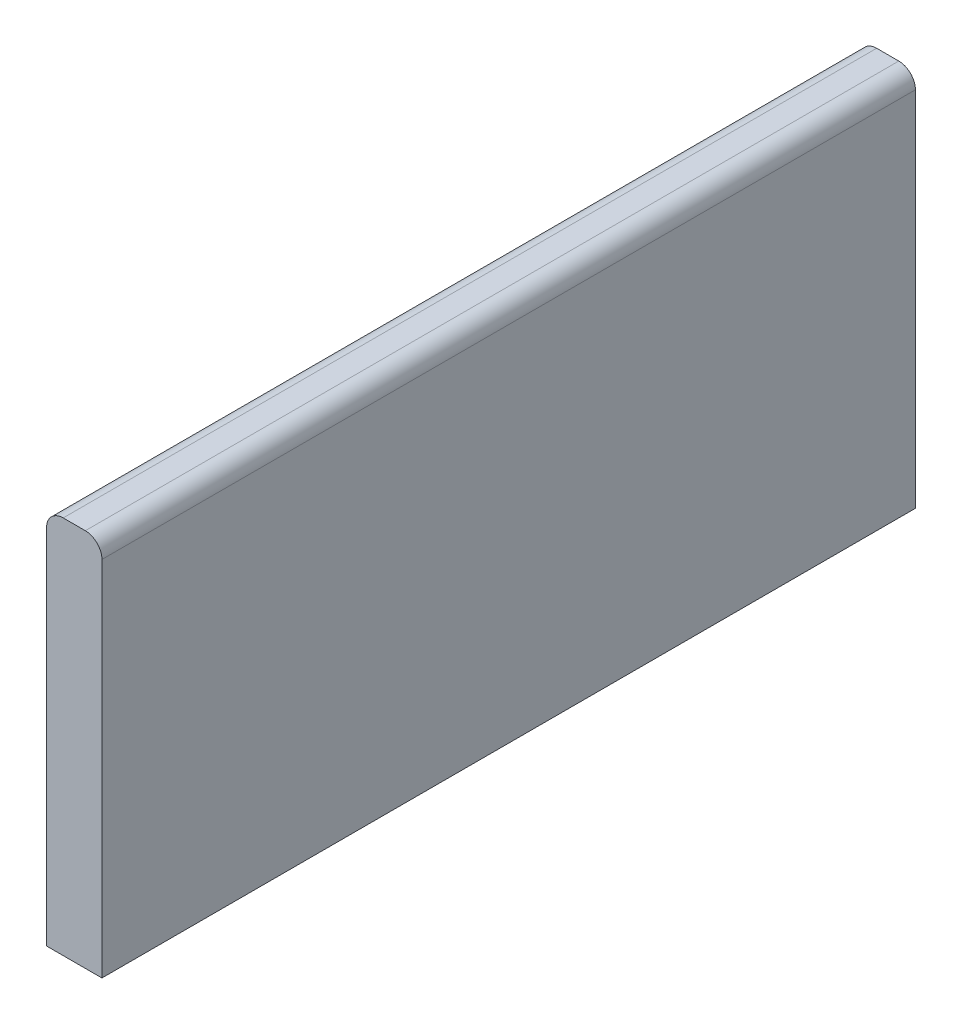
ISO-10303-21;
HEADER;
FILE_DESCRIPTION(('STEP AP214'),'2;1');
FILE_NAME('part.step','',(''),(''),'','','');
FILE_SCHEMA(('AUTOMOTIVE_DESIGN { 1 0 10303 214 1 1 1 1 }'));
ENDSEC;
DATA;
#1=APPLICATION_CONTEXT('core data for automotive mechanical design processes');
#2=APPLICATION_PROTOCOL_DEFINITION('international standard','automotive_design',2000,#1);
#3=PRODUCT_CONTEXT('',#1,'mechanical');
#4=PRODUCT('Part','Part','',(#3));
#5=PRODUCT_RELATED_PRODUCT_CATEGORY('part','',(#4));
#6=PRODUCT_DEFINITION_FORMATION('','',#4);
#7=PRODUCT_DEFINITION_CONTEXT('part definition',#1,'design');
#8=PRODUCT_DEFINITION('design','',#6,#7);
#9=PRODUCT_DEFINITION_SHAPE('','',#8);
#10=(LENGTH_UNIT() NAMED_UNIT(*) SI_UNIT(.MILLI.,.METRE.));
#11=(NAMED_UNIT(*) PLANE_ANGLE_UNIT() SI_UNIT($,.RADIAN.));
#12=(NAMED_UNIT(*) SI_UNIT($,.STERADIAN.) SOLID_ANGLE_UNIT());
#13=UNCERTAINTY_MEASURE_WITH_UNIT(LENGTH_MEASURE(1.E-05),#10,'distance_accuracy_value','');
#14=(GEOMETRIC_REPRESENTATION_CONTEXT(3) GLOBAL_UNCERTAINTY_ASSIGNED_CONTEXT((#13)) GLOBAL_UNIT_ASSIGNED_CONTEXT((#10,
#11,#12)) REPRESENTATION_CONTEXT('',''));
#15=CARTESIAN_POINT('',(0.,0.,0.));
#16=DIRECTION('',(0.,0.,1.));
#17=DIRECTION('',(1.,0.,0.));
#18=AXIS2_PLACEMENT_3D('',#15,#16,#17);
#19=CARTESIAN_POINT('',(-95.,-4.99999999999998,216.226078900946));
#20=DIRECTION('',(-1.,0.,0.));
#21=DIRECTION('',(0.,-1.,0.));
#22=AXIS2_PLACEMENT_3D('',#19,#20,#21);
#23=PLANE('',#22);
#24=DIRECTION('',(0.,1.,0.));
#25=VECTOR('',#24,1.);
#26=CARTESIAN_POINT('',(-95.,-4.99999999999998,0.));
#27=LINE('',#26,#25);
#28=CARTESIAN_POINT('',(-95.,-73.5000000000002,0.));
#29=VERTEX_POINT('',#28);
#30=CARTESIAN_POINT('',(-95.,-7.99999999999998,0.));
#31=VERTEX_POINT('',#30);
#32=EDGE_CURVE('E132',#29,#31,#27,.T.);
#33=ORIENTED_EDGE('',*,*,#32,.T.);
#34=DIRECTION('',(0.,0.,-1.));
#35=VECTOR('',#34,1.);
#36=CARTESIAN_POINT('',(-95.,-7.99999999999998,216.226078900946));
#37=LINE('',#36,#35);
#38=CARTESIAN_POINT('',(-95.,-7.99999999999998,147.));
#39=VERTEX_POINT('',#38);
#40=EDGE_CURVE('E11',#31,#39,#37,.F.);
#41=ORIENTED_EDGE('',*,*,#40,.T.);
#42=DIRECTION('',(0.,1.,0.));
#43=VECTOR('',#42,1.);
#44=CARTESIAN_POINT('',(-95.,-4.99999999999998,147.));
#45=LINE('',#44,#43);
#46=CARTESIAN_POINT('',(-95.,-73.5000000000002,147.));
#47=VERTEX_POINT('',#46);
#48=EDGE_CURVE('E122',#47,#39,#45,.T.);
#49=ORIENTED_EDGE('',*,*,#48,.F.);
#50=DIRECTION('',(0.,0.,-1.));
#51=VECTOR('',#50,1.);
#52=CARTESIAN_POINT('',(-95.,-73.5000000000002,216.226078900946));
#53=LINE('',#52,#51);
#54=EDGE_CURVE('E120',#47,#29,#53,.T.);
#55=ORIENTED_EDGE('',*,*,#54,.T.);
#56=EDGE_LOOP('',(#33,#41,#49,#55));
#57=FACE_BOUND('',#56,.T.);
#58=ADVANCED_FACE('F39',(#57),#23,.F.);
#59=CARTESIAN_POINT('',(-95.,-4.99999999999998,216.226078900946));
#60=DIRECTION('',(0.,-1.,0.));
#61=DIRECTION('',(0.,0.,-1.));
#62=AXIS2_PLACEMENT_3D('',#59,#60,#61);
#63=PLANE('',#62);
#64=DIRECTION('',(-1.,0.,0.));
#65=VECTOR('',#64,1.);
#66=CARTESIAN_POINT('',(-95.,-4.99999999999998,0.));
#67=LINE('',#66,#65);
#68=CARTESIAN_POINT('',(-98.,-4.99999999999998,0.));
#69=VERTEX_POINT('',#68);
#70=CARTESIAN_POINT('',(-102.,-4.99999999999998,0.));
#71=VERTEX_POINT('',#70);
#72=EDGE_CURVE('E154',#69,#71,#67,.T.);
#73=ORIENTED_EDGE('',*,*,#72,.T.);
#74=DIRECTION('',(0.,0.,-1.));
#75=VECTOR('',#74,1.);
#76=CARTESIAN_POINT('',(-102.,-4.99999999999998,216.226078900946));
#77=LINE('',#76,#75);
#78=CARTESIAN_POINT('',(-102.,-4.99999999999998,147.));
#79=VERTEX_POINT('',#78);
#80=EDGE_CURVE('E61',#71,#79,#77,.F.);
#81=ORIENTED_EDGE('',*,*,#80,.T.);
#82=DIRECTION('',(-1.,0.,0.));
#83=VECTOR('',#82,1.);
#84=CARTESIAN_POINT('',(-95.,-4.99999999999998,147.));
#85=LINE('',#84,#83);
#86=CARTESIAN_POINT('',(-98.,-4.99999999999998,147.));
#87=VERTEX_POINT('',#86);
#88=EDGE_CURVE('E106',#87,#79,#85,.T.);
#89=ORIENTED_EDGE('',*,*,#88,.F.);
#90=DIRECTION('',(0.,0.,-1.));
#91=VECTOR('',#90,1.);
#92=CARTESIAN_POINT('',(-98.,-4.99999999999998,216.226078900946));
#93=LINE('',#92,#91);
#94=EDGE_CURVE('E141',#87,#69,#93,.T.);
#95=ORIENTED_EDGE('',*,*,#94,.T.);
#96=EDGE_LOOP('',(#73,#81,#89,#95));
#97=FACE_BOUND('',#96,.T.);
#98=ADVANCED_FACE('F159',(#97),#63,.F.);
#99=CARTESIAN_POINT('',(-105.,-4.99999999999998,216.226078900946));
#100=DIRECTION('',(1.,0.,0.));
#101=DIRECTION('',(0.,1.,0.));
#102=AXIS2_PLACEMENT_3D('',#99,#100,#101);
#103=PLANE('',#102);
#104=DIRECTION('',(0.,-1.,0.));
#105=VECTOR('',#104,1.);
#106=CARTESIAN_POINT('',(-105.,-4.99999999999998,147.));
#107=LINE('',#106,#105);
#108=CARTESIAN_POINT('',(-105.,-7.99999999999998,147.));
#109=VERTEX_POINT('',#108);
#110=CARTESIAN_POINT('',(-105.,-73.5000000000002,147.));
#111=VERTEX_POINT('',#110);
#112=EDGE_CURVE('E95',#109,#111,#107,.T.);
#113=ORIENTED_EDGE('',*,*,#112,.F.);
#114=DIRECTION('',(0.,0.,-1.));
#115=VECTOR('',#114,1.);
#116=CARTESIAN_POINT('',(-105.,-7.99999999999998,216.226078900946));
#117=LINE('',#116,#115);
#118=CARTESIAN_POINT('',(-105.,-7.99999999999998,0.));
#119=VERTEX_POINT('',#118);
#120=EDGE_CURVE('E105',#109,#119,#117,.T.);
#121=ORIENTED_EDGE('',*,*,#120,.T.);
#122=DIRECTION('',(0.,-1.,0.));
#123=VECTOR('',#122,1.);
#124=CARTESIAN_POINT('',(-105.,-4.99999999999998,0.));
#125=LINE('',#124,#123);
#126=CARTESIAN_POINT('',(-105.,-73.5000000000002,0.));
#127=VERTEX_POINT('',#126);
#128=EDGE_CURVE('E112',#119,#127,#125,.T.);
#129=ORIENTED_EDGE('',*,*,#128,.T.);
#130=DIRECTION('',(0.,0.,-1.));
#131=VECTOR('',#130,1.);
#132=CARTESIAN_POINT('',(-105.,-73.5000000000002,216.226078900946));
#133=LINE('',#132,#131);
#134=EDGE_CURVE('E109',#111,#127,#133,.T.);
#135=ORIENTED_EDGE('',*,*,#134,.F.);
#136=EDGE_LOOP('',(#113,#121,#129,#135));
#137=FACE_BOUND('',#136,.T.);
#138=ADVANCED_FACE('F110',(#137),#103,.F.);
#139=CARTESIAN_POINT('',(-95.,-73.5000000000002,216.226078900946));
#140=DIRECTION('',(0.,1.,0.));
#141=DIRECTION('',(0.,0.,1.));
#142=AXIS2_PLACEMENT_3D('',#139,#140,#141);
#143=PLANE('',#142);
#144=DIRECTION('',(1.,0.,0.));
#145=VECTOR('',#144,1.);
#146=CARTESIAN_POINT('',(-95.,-73.5000000000002,147.));
#147=LINE('',#146,#145);
#148=EDGE_CURVE('E99',#111,#47,#147,.T.);
#149=ORIENTED_EDGE('',*,*,#148,.F.);
#150=ORIENTED_EDGE('',*,*,#134,.T.);
#151=DIRECTION('',(1.,0.,0.));
#152=VECTOR('',#151,1.);
#153=CARTESIAN_POINT('',(-95.,-73.5000000000002,0.));
#154=LINE('',#153,#152);
#155=EDGE_CURVE('E117',#127,#29,#154,.T.);
#156=ORIENTED_EDGE('',*,*,#155,.T.);
#157=ORIENTED_EDGE('',*,*,#54,.F.);
#158=EDGE_LOOP('',(#149,#150,#156,#157));
#159=FACE_BOUND('',#158,.T.);
#160=ADVANCED_FACE('F119',(#159),#143,.F.);
#161=CARTESIAN_POINT('',(0.,0.,0.));
#162=DIRECTION('',(0.,0.,-1.));
#163=DIRECTION('',(-1.,0.,0.));
#164=AXIS2_PLACEMENT_3D('',#161,#162,#163);
#165=PLANE('',#164);
#166=ORIENTED_EDGE('',*,*,#128,.F.);
#167=CARTESIAN_POINT('',(-102.,-7.99999999999998,0.));
#168=DIRECTION('',(0.,0.,-1.));
#169=DIRECTION('',(-1.,0.,0.));
#170=AXIS2_PLACEMENT_3D('',#167,#168,#169);
#171=CIRCLE('',#170,3.);
#172=EDGE_CURVE('E138',#119,#71,#171,.T.);
#173=ORIENTED_EDGE('',*,*,#172,.T.);
#174=ORIENTED_EDGE('',*,*,#72,.F.);
#175=CARTESIAN_POINT('',(-98.,-7.99999999999998,0.));
#176=DIRECTION('',(0.,0.,-1.));
#177=DIRECTION('',(-1.,0.,0.));
#178=AXIS2_PLACEMENT_3D('',#175,#176,#177);
#179=CIRCLE('',#178,3.);
#180=EDGE_CURVE('E135',#69,#31,#179,.T.);
#181=ORIENTED_EDGE('',*,*,#180,.T.);
#182=ORIENTED_EDGE('',*,*,#32,.F.);
#183=ORIENTED_EDGE('',*,*,#155,.F.);
#184=EDGE_LOOP('',(#166,#173,#174,#181,#182,#183));
#185=FACE_BOUND('',#184,.T.);
#186=ADVANCED_FACE('F164',(#185),#165,.T.);
#187=CARTESIAN_POINT('',(-1.31838984174237E-13,-536.02351291583,147.));
#188=DIRECTION('',(0.,0.,1.));
#189=DIRECTION('',(0.,1.,0.));
#190=AXIS2_PLACEMENT_3D('',#187,#188,#189);
#191=PLANE('',#190);
#192=ORIENTED_EDGE('',*,*,#88,.T.);
#193=CARTESIAN_POINT('',(-102.,-7.99999999999998,147.));
#194=DIRECTION('',(0.,0.,1.));
#195=DIRECTION('',(1.,0.,0.));
#196=AXIS2_PLACEMENT_3D('',#193,#194,#195);
#197=CIRCLE('',#196,3.);
#198=EDGE_CURVE('E48',#79,#109,#197,.T.);
#199=ORIENTED_EDGE('',*,*,#198,.T.);
#200=ORIENTED_EDGE('',*,*,#112,.T.);
#201=ORIENTED_EDGE('',*,*,#148,.T.);
#202=ORIENTED_EDGE('',*,*,#48,.T.);
#203=CARTESIAN_POINT('',(-98.,-7.99999999999998,147.));
#204=DIRECTION('',(0.,0.,1.));
#205=DIRECTION('',(1.,0.,0.));
#206=AXIS2_PLACEMENT_3D('',#203,#204,#205);
#207=CIRCLE('',#206,3.);
#208=EDGE_CURVE('E147',#39,#87,#207,.T.);
#209=ORIENTED_EDGE('',*,*,#208,.T.);
#210=EDGE_LOOP('',(#192,#199,#200,#201,#202,#209));
#211=FACE_BOUND('',#210,.T.);
#212=ADVANCED_FACE('F97',(#211),#191,.T.);
#213=CARTESIAN_POINT('',(-102.,-7.99999999999998,216.226078900946));
#214=DIRECTION('',(0.,0.,-1.));
#215=DIRECTION('',(-1.,0.,0.));
#216=AXIS2_PLACEMENT_3D('',#213,#214,#215);
#217=CYLINDRICAL_SURFACE('',#216,3.);
#218=ORIENTED_EDGE('',*,*,#198,.F.);
#219=ORIENTED_EDGE('',*,*,#80,.F.);
#220=ORIENTED_EDGE('',*,*,#172,.F.);
#221=ORIENTED_EDGE('',*,*,#120,.F.);
#222=EDGE_LOOP('',(#218,#219,#220,#221));
#223=FACE_BOUND('',#222,.T.);
#224=ADVANCED_FACE('F163',(#223),#217,.T.);
#225=CARTESIAN_POINT('',(-98.,-7.99999999999998,216.226078900946));
#226=DIRECTION('',(0.,0.,-1.));
#227=DIRECTION('',(-1.,0.,0.));
#228=AXIS2_PLACEMENT_3D('',#225,#226,#227);
#229=CYLINDRICAL_SURFACE('',#228,3.);
#230=ORIENTED_EDGE('',*,*,#208,.F.);
#231=ORIENTED_EDGE('',*,*,#40,.F.);
#232=ORIENTED_EDGE('',*,*,#180,.F.);
#233=ORIENTED_EDGE('',*,*,#94,.F.);
#234=EDGE_LOOP('',(#230,#231,#232,#233));
#235=FACE_BOUND('',#234,.T.);
#236=ADVANCED_FACE('F41',(#235),#229,.T.);
#237=CLOSED_SHELL('',(#58,#98,#138,#160,#186,#212,#224,#236));
#238=MANIFOLD_SOLID_BREP('B2',#237);
#239=ADVANCED_BREP_SHAPE_REPRESENTATION('',(#18,#238),#14);
#240=SHAPE_DEFINITION_REPRESENTATION(#9,#239);
ENDSEC;
END-ISO-10303-21;
